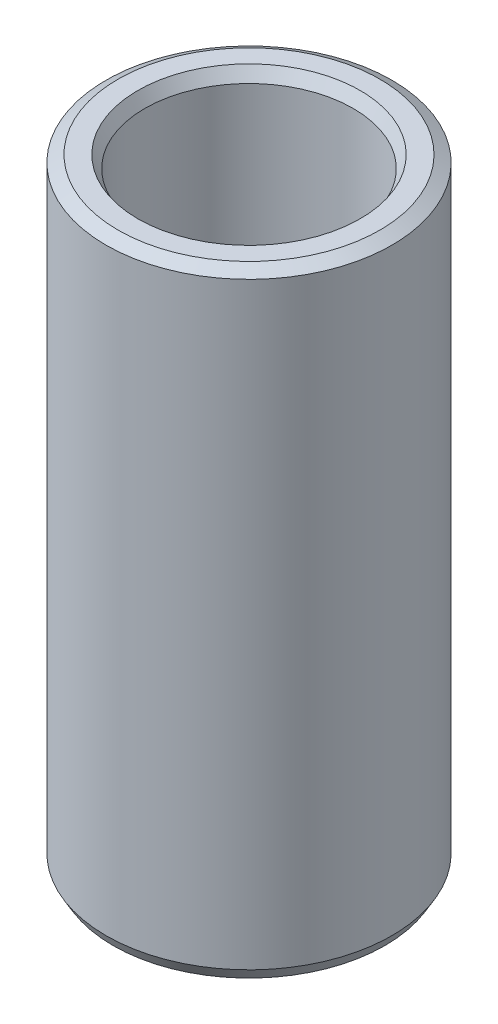
ISO-10303-21;
HEADER;
FILE_DESCRIPTION(('STEP AP214'),'2;1');
FILE_NAME('part.step','',(''),(''),'','','');
FILE_SCHEMA(('AUTOMOTIVE_DESIGN { 1 0 10303 214 1 1 1 1 }'));
ENDSEC;
DATA;
#1=APPLICATION_CONTEXT('core data for automotive mechanical design processes');
#2=APPLICATION_PROTOCOL_DEFINITION('international standard','automotive_design',2000,#1);
#3=PRODUCT_CONTEXT('',#1,'mechanical');
#4=PRODUCT('Part','Part','',(#3));
#5=PRODUCT_RELATED_PRODUCT_CATEGORY('part','',(#4));
#6=PRODUCT_DEFINITION_FORMATION('','',#4);
#7=PRODUCT_DEFINITION_CONTEXT('part definition',#1,'design');
#8=PRODUCT_DEFINITION('design','',#6,#7);
#9=PRODUCT_DEFINITION_SHAPE('','',#8);
#10=(LENGTH_UNIT() NAMED_UNIT(*) SI_UNIT(.MILLI.,.METRE.));
#11=(NAMED_UNIT(*) PLANE_ANGLE_UNIT() SI_UNIT($,.RADIAN.));
#12=(NAMED_UNIT(*) SI_UNIT($,.STERADIAN.) SOLID_ANGLE_UNIT());
#13=UNCERTAINTY_MEASURE_WITH_UNIT(LENGTH_MEASURE(1.E-05),#10,'distance_accuracy_value','');
#14=(GEOMETRIC_REPRESENTATION_CONTEXT(3) GLOBAL_UNCERTAINTY_ASSIGNED_CONTEXT((#13)) GLOBAL_UNIT_ASSIGNED_CONTEXT((#10,
#11,#12)) REPRESENTATION_CONTEXT('',''));
#15=CARTESIAN_POINT('',(0.,0.,0.));
#16=DIRECTION('',(0.,0.,1.));
#17=DIRECTION('',(1.,0.,0.));
#18=AXIS2_PLACEMENT_3D('',#15,#16,#17);
#19=CARTESIAN_POINT('',(0.,64.7549065716284,0.));
#20=DIRECTION('',(0.,-1.,0.));
#21=DIRECTION('',(0.,0.,-1.));
#22=AXIS2_PLACEMENT_3D('',#19,#20,#21);
#23=CYLINDRICAL_SURFACE('',#22,15.);
#24=CARTESIAN_POINT('',(0.,1.26769654452136,0.));
#25=DIRECTION('',(0.,1.,0.));
#26=DIRECTION('',(0.,0.,1.));
#27=AXIS2_PLACEMENT_3D('',#24,#25,#26);
#28=CIRCLE('',#27,15.);
#29=CARTESIAN_POINT('',(0.,1.26769654452136,15.));
#30=VERTEX_POINT('',#29);
#31=EDGE_CURVE('E10',#30,#30,#28,.T.);
#32=ORIENTED_EDGE('',*,*,#31,.T.);
#33=EDGE_LOOP('',(#32));
#34=FACE_BOUND('',#33,.T.);
#35=CARTESIAN_POINT('',(0.,64.0230016303983,0.));
#36=DIRECTION('',(0.,1.,0.));
#37=DIRECTION('',(0.,0.,1.));
#38=AXIS2_PLACEMENT_3D('',#35,#36,#37);
#39=CIRCLE('',#38,15.);
#40=CARTESIAN_POINT('',(0.,64.0230016303983,15.));
#41=VERTEX_POINT('',#40);
#42=EDGE_CURVE('E50',#41,#41,#39,.F.);
#43=ORIENTED_EDGE('',*,*,#42,.T.);
#44=EDGE_LOOP('',(#43));
#45=FACE_BOUND('',#44,.T.);
#46=ADVANCED_FACE('F39',(#34,#45),#23,.T.);
#47=CARTESIAN_POINT('',(0.,64.7549065716284,0.));
#48=DIRECTION('',(0.,1.,0.));
#49=DIRECTION('',(0.,0.,1.));
#50=AXIS2_PLACEMENT_3D('',#47,#48,#49);
#51=PLANE('',#50);
#52=CARTESIAN_POINT('',(0.,64.7549065716284,0.));
#53=DIRECTION('',(0.,1.,0.));
#54=DIRECTION('',(0.,0.,1.));
#55=AXIS2_PLACEMENT_3D('',#52,#53,#54);
#56=CIRCLE('',#55,11.6679525664355);
#57=CARTESIAN_POINT('',(0.,64.7549065716284,11.6679525664355));
#58=VERTEX_POINT('',#57);
#59=EDGE_CURVE('E58',#58,#58,#56,.F.);
#60=ORIENTED_EDGE('',*,*,#59,.T.);
#61=EDGE_LOOP('',(#60));
#62=FACE_BOUND('',#61,.T.);
#63=CARTESIAN_POINT('',(0.,64.7549065716284,0.));
#64=DIRECTION('',(0.,1.,0.));
#65=DIRECTION('',(0.,0.,1.));
#66=AXIS2_PLACEMENT_3D('',#63,#64,#65);
#67=CIRCLE('',#66,13.7323034554786);
#68=CARTESIAN_POINT('',(0.,64.7549065716284,13.7323034554786));
#69=VERTEX_POINT('',#68);
#70=EDGE_CURVE('E61',#69,#69,#67,.T.);
#71=ORIENTED_EDGE('',*,*,#70,.T.);
#72=EDGE_LOOP('',(#71));
#73=FACE_BOUND('',#72,.T.);
#74=ADVANCED_FACE('F88',(#62,#73),#51,.T.);
#75=CARTESIAN_POINT('',(0.,0.,0.));
#76=DIRECTION('',(0.,1.,0.));
#77=DIRECTION('',(0.,0.,1.));
#78=AXIS2_PLACEMENT_3D('',#75,#76,#77);
#79=PLANE('',#78);
#80=CARTESIAN_POINT('',(0.,0.,0.));
#81=DIRECTION('',(0.,1.,0.));
#82=DIRECTION('',(0.,0.,1.));
#83=AXIS2_PLACEMENT_3D('',#80,#81,#82);
#84=CIRCLE('',#83,12.2037441697267);
#85=CARTESIAN_POINT('',(0.,0.,12.2037441697267));
#86=VERTEX_POINT('',#85);
#87=EDGE_CURVE('E51',#86,#86,#84,.T.);
#88=ORIENTED_EDGE('',*,*,#87,.T.);
#89=EDGE_LOOP('',(#88));
#90=FACE_BOUND('',#89,.T.);
#91=CARTESIAN_POINT('',(0.,0.,0.));
#92=DIRECTION('',(0.,1.,0.));
#93=DIRECTION('',(0.,0.,1.));
#94=AXIS2_PLACEMENT_3D('',#91,#92,#93);
#95=CIRCLE('',#94,14.2680950587698);
#96=CARTESIAN_POINT('',(0.,0.,14.2680950587698));
#97=VERTEX_POINT('',#96);
#98=EDGE_CURVE('E54',#97,#97,#95,.F.);
#99=ORIENTED_EDGE('',*,*,#98,.T.);
#100=EDGE_LOOP('',(#99));
#101=FACE_BOUND('',#100,.T.);
#102=ADVANCED_FACE('F83',(#90,#101),#79,.F.);
#103=CARTESIAN_POINT('',(0.,64.7549065716284,0.));
#104=DIRECTION('',(0.,-1.,0.));
#105=DIRECTION('',(0.,0.,-1.));
#106=AXIS2_PLACEMENT_3D('',#103,#104,#105);
#107=CYLINDRICAL_SURFACE('',#106,10.9360476252053);
#108=CARTESIAN_POINT('',(0.,63.487210027107,0.));
#109=DIRECTION('',(0.,1.,0.));
#110=DIRECTION('',(0.,0.,1.));
#111=AXIS2_PLACEMENT_3D('',#108,#109,#110);
#112=CIRCLE('',#111,10.9360476252053);
#113=CARTESIAN_POINT('',(0.,63.487210027107,10.9360476252053));
#114=VERTEX_POINT('',#113);
#115=EDGE_CURVE('E67',#114,#114,#112,.T.);
#116=ORIENTED_EDGE('',*,*,#115,.T.);
#117=EDGE_LOOP('',(#116));
#118=FACE_BOUND('',#117,.T.);
#119=CARTESIAN_POINT('',(0.,0.731904941230183,0.));
#120=DIRECTION('',(0.,1.,0.));
#121=DIRECTION('',(0.,0.,1.));
#122=AXIS2_PLACEMENT_3D('',#119,#120,#121);
#123=CIRCLE('',#122,10.9360476252053);
#124=CARTESIAN_POINT('',(0.,0.731904941230183,10.9360476252053));
#125=VERTEX_POINT('',#124);
#126=EDGE_CURVE('E69',#125,#125,#123,.F.);
#127=ORIENTED_EDGE('',*,*,#126,.T.);
#128=EDGE_LOOP('',(#127));
#129=FACE_BOUND('',#128,.T.);
#130=ADVANCED_FACE('F71',(#118,#129),#107,.F.);
#131=CARTESIAN_POINT('',(0.,63.487210027107,0.));
#132=DIRECTION('',(0.,1.,0.));
#133=DIRECTION('',(0.,0.,1.));
#134=AXIS2_PLACEMENT_3D('',#131,#132,#133);
#135=CONICAL_SURFACE('',#134,10.9360476252053,0.523598775598301);
#136=CARTESIAN_POINT('',(0.,64.7549065716284,11.6679525664355));
#137=CARTESIAN_POINT('',(0.,64.7417013992897,11.660328556631));
#138=CARTESIAN_POINT('',(0.,64.7284962269509,11.6527045468265));
#139=CARTESIAN_POINT('',(0.,64.7020858822734,11.6374565272176));
#140=CARTESIAN_POINT('',(0.,64.6888807099346,11.6298325174131));
#141=CARTESIAN_POINT('',(0.,64.6624703652571,11.6145844978041));
#142=CARTESIAN_POINT('',(0.,64.6492651929183,11.6069604879996));
#143=CARTESIAN_POINT('',(0.,64.6228548482408,11.5917124683907));
#144=CARTESIAN_POINT('',(0.,64.609649675902,11.5840884585862));
#145=CARTESIAN_POINT('',(0.,64.5832393312245,11.5688404389772));
#146=CARTESIAN_POINT('',(0.,64.5700341588857,11.5612164291727));
#147=CARTESIAN_POINT('',(0.,64.5436238142082,11.5459684095638));
#148=CARTESIAN_POINT('',(0.,64.5304186418694,11.5383443997593));
#149=CARTESIAN_POINT('',(0.,64.5040082971919,11.5230963801503));
#150=CARTESIAN_POINT('',(0.,64.4908031248531,11.5154723703459));
#151=CARTESIAN_POINT('',(0.,64.4643927801756,11.5002243507369));
#152=CARTESIAN_POINT('',(0.,64.4511876078368,11.4926003409324));
#153=CARTESIAN_POINT('',(0.,64.4247772631593,11.4773523213235));
#154=CARTESIAN_POINT('',(0.,64.4115720908205,11.469728311519));
#155=CARTESIAN_POINT('',(0.,64.385161746143,11.45448029191));
#156=CARTESIAN_POINT('',(0.,64.3719565738043,11.4468562821055));
#157=CARTESIAN_POINT('',(0.,64.3455462291267,11.4316082624966));
#158=CARTESIAN_POINT('',(0.,64.332341056788,11.4239842526921));
#159=CARTESIAN_POINT('',(0.,64.3059307121104,11.4087362330831));
#160=CARTESIAN_POINT('',(0.,64.2927255397717,11.4011122232786));
#161=CARTESIAN_POINT('',(0.,64.2663151950941,11.3858642036697));
#162=CARTESIAN_POINT('',(0.,64.2531100227554,11.3782401938652));
#163=CARTESIAN_POINT('',(0.,64.2266996780778,11.3629921742562));
#164=CARTESIAN_POINT('',(0.,64.2134945057391,11.3553681644518));
#165=CARTESIAN_POINT('',(0.,64.1870841610615,11.3401201448428));
#166=CARTESIAN_POINT('',(0.,64.1738789887228,11.3324961350383));
#167=CARTESIAN_POINT('',(0.,64.1474686440452,11.3172481154293));
#168=CARTESIAN_POINT('',(0.,64.1342634717065,11.3096241056249));
#169=CARTESIAN_POINT('',(0.,64.107853127029,11.2943760860159));
#170=CARTESIAN_POINT('',(0.,64.0946479546902,11.2867520762114));
#171=CARTESIAN_POINT('',(0.,64.0682376100127,11.2715040566025));
#172=CARTESIAN_POINT('',(0.,64.0550324376739,11.263880046798));
#173=CARTESIAN_POINT('',(0.,64.0286220929964,11.248632027189));
#174=CARTESIAN_POINT('',(0.,64.0154169206576,11.2410080173845));
#175=CARTESIAN_POINT('',(0.,63.9890065759801,11.2257599977756));
#176=CARTESIAN_POINT('',(0.,63.9758014036413,11.2181359879711));
#177=CARTESIAN_POINT('',(0.,63.9493910589638,11.2028879683621));
#178=CARTESIAN_POINT('',(0.,63.936185886625,11.1952639585576));
#179=CARTESIAN_POINT('',(0.,63.9097755419475,11.1800159389487));
#180=CARTESIAN_POINT('',(0.,63.8965703696087,11.1723919291442));
#181=CARTESIAN_POINT('',(0.,63.8701600249312,11.1571439095352));
#182=CARTESIAN_POINT('',(0.,63.8569548525924,11.1495198997308));
#183=CARTESIAN_POINT('',(0.,63.8305445079149,11.1342718801218));
#184=CARTESIAN_POINT('',(0.,63.8173393355761,11.1266478703173));
#185=CARTESIAN_POINT('',(0.,63.7909289908986,11.1113998507084));
#186=CARTESIAN_POINT('',(0.,63.7777238185598,11.1037758409039));
#187=CARTESIAN_POINT('',(0.,63.7513134738823,11.0885278212949));
#188=CARTESIAN_POINT('',(0.,63.7381083015436,11.0809038114904));
#189=CARTESIAN_POINT('',(0.,63.711697956866,11.0656557918815));
#190=CARTESIAN_POINT('',(0.,63.6984927845273,11.058031782077));
#191=CARTESIAN_POINT('',(0.,63.6720824398497,11.042783762468));
#192=CARTESIAN_POINT('',(0.,63.658877267511,11.0351597526635));
#193=CARTESIAN_POINT('',(0.,63.6324669228334,11.0199117330546));
#194=CARTESIAN_POINT('',(0.,63.6192617504947,11.0122877232501));
#195=CARTESIAN_POINT('',(0.,63.5928514058171,10.9970397036411));
#196=CARTESIAN_POINT('',(0.,63.5796462334784,10.9894156938367));
#197=CARTESIAN_POINT('',(0.,63.5532358888008,10.9741676742277));
#198=CARTESIAN_POINT('',(0.,63.5400307164621,10.9665436644232));
#199=CARTESIAN_POINT('',(0.,63.5136203717846,10.9512956448143));
#200=CARTESIAN_POINT('',(0.,63.5004151994458,10.9436716350098));
#201=CARTESIAN_POINT('',(0.,63.487210027107,10.9360476252053));
#202=B_SPLINE_CURVE_WITH_KNOTS('',3,(#136,#137,#138,#139,#140,#141,#142,#143,#144,#145,#146,
#147,#148,#149,#150,#151,#152,#153,#154,#155,#156,#157,#158,#159,#160,#161,#162,#163,#164,#165,
#166,#167,#168,#169,#170,#171,#172,#173,#174,#175,#176,#177,#178,#179,#180,#181,#182,#183,#184,
#185,#186,#187,#188,#189,#190,#191,#192,#193,#194,#195,#196,#197,#198,#199,#200,#201),
.UNSPECIFIED.,.F.,.F.,(4,2,2,2,2,2,2,2,2,2,2,2,2,2,2,2,2,2,2,2,2,2,2,2,2,2,2,2,2,2,2,2,4),(0.,
0.0457440588268785,0.0914881176537689,0.137232176480659,0.18297623530755,0.228720294134427,
0.274464352961318,0.320208411788208,0.365952470615099,0.411696529441977,0.457440588268867,
0.503184647095757,0.548928705922648,0.594672764749526,0.640416823576417,0.686160882403308,
0.731904941230197,0.777649000057076,0.823393058883966,0.869137117710857,0.914881176537747,
0.960625235364625,1.00636929419152,1.05211335301841,1.0978574118453,1.14360147067217,
1.18934552949906,1.23508958832595,1.28083364715285,1.32657770597972,1.37232176480661,
1.4180658236335,1.46380988246038),.UNSPECIFIED.);
#203=EDGE_CURVE('BSEAM77',#58,#114,#202,.T.);
#204=ORIENTED_EDGE('',*,*,#59,.F.);
#205=ORIENTED_EDGE('',*,*,#115,.F.);
#206=ORIENTED_EDGE('',*,*,#203,.T.);
#207=ORIENTED_EDGE('',*,*,#203,.F.);
#208=EDGE_LOOP('',(#204,#206,#205,#207));
#209=FACE_BOUND('',#208,.T.);
#210=ADVANCED_FACE('F77',(#209),#135,.F.);
#211=CARTESIAN_POINT('',(0.,0.,0.));
#212=DIRECTION('',(0.,-1.,0.));
#213=DIRECTION('',(0.,0.,-1.));
#214=AXIS2_PLACEMENT_3D('',#211,#212,#213);
#215=CONICAL_SURFACE('',#214,12.2037441697267,1.0471975511966);
#216=ORIENTED_EDGE('',*,*,#126,.F.);
#217=EDGE_LOOP('',(#216));
#218=FACE_BOUND('',#217,.T.);
#219=ORIENTED_EDGE('',*,*,#87,.F.);
#220=EDGE_LOOP('',(#219));
#221=FACE_BOUND('',#220,.T.);
#222=ADVANCED_FACE('F73',(#218,#221),#215,.F.);
#223=CARTESIAN_POINT('',(0.,1.26769654452136,0.));
#224=DIRECTION('',(0.,1.,0.));
#225=DIRECTION('',(0.,0.,1.));
#226=AXIS2_PLACEMENT_3D('',#223,#224,#225);
#227=CONICAL_SURFACE('',#226,15.,0.523598775598302);
#228=ORIENTED_EDGE('',*,*,#98,.F.);
#229=EDGE_LOOP('',(#228));
#230=FACE_BOUND('',#229,.T.);
#231=ORIENTED_EDGE('',*,*,#31,.F.);
#232=EDGE_LOOP('',(#231));
#233=FACE_BOUND('',#232,.T.);
#234=ADVANCED_FACE('F76',(#230,#233),#227,.T.);
#235=CARTESIAN_POINT('',(0.,64.7549065716284,0.));
#236=DIRECTION('',(0.,-1.,0.));
#237=DIRECTION('',(0.,0.,-1.));
#238=AXIS2_PLACEMENT_3D('',#235,#236,#237);
#239=CONICAL_SURFACE('',#238,13.7323034554786,1.0471975511966);
#240=ORIENTED_EDGE('',*,*,#42,.F.);
#241=EDGE_LOOP('',(#240));
#242=FACE_BOUND('',#241,.T.);
#243=ORIENTED_EDGE('',*,*,#70,.F.);
#244=EDGE_LOOP('',(#243));
#245=FACE_BOUND('',#244,.T.);
#246=ADVANCED_FACE('F45',(#242,#245),#239,.T.);
#247=CLOSED_SHELL('',(#46,#74,#102,#130,#210,#222,#234,#246));
#248=MANIFOLD_SOLID_BREP('B2',#247);
#249=ADVANCED_BREP_SHAPE_REPRESENTATION('',(#18,#248),#14);
#250=SHAPE_DEFINITION_REPRESENTATION(#9,#249);
ENDSEC;
END-ISO-10303-21;
